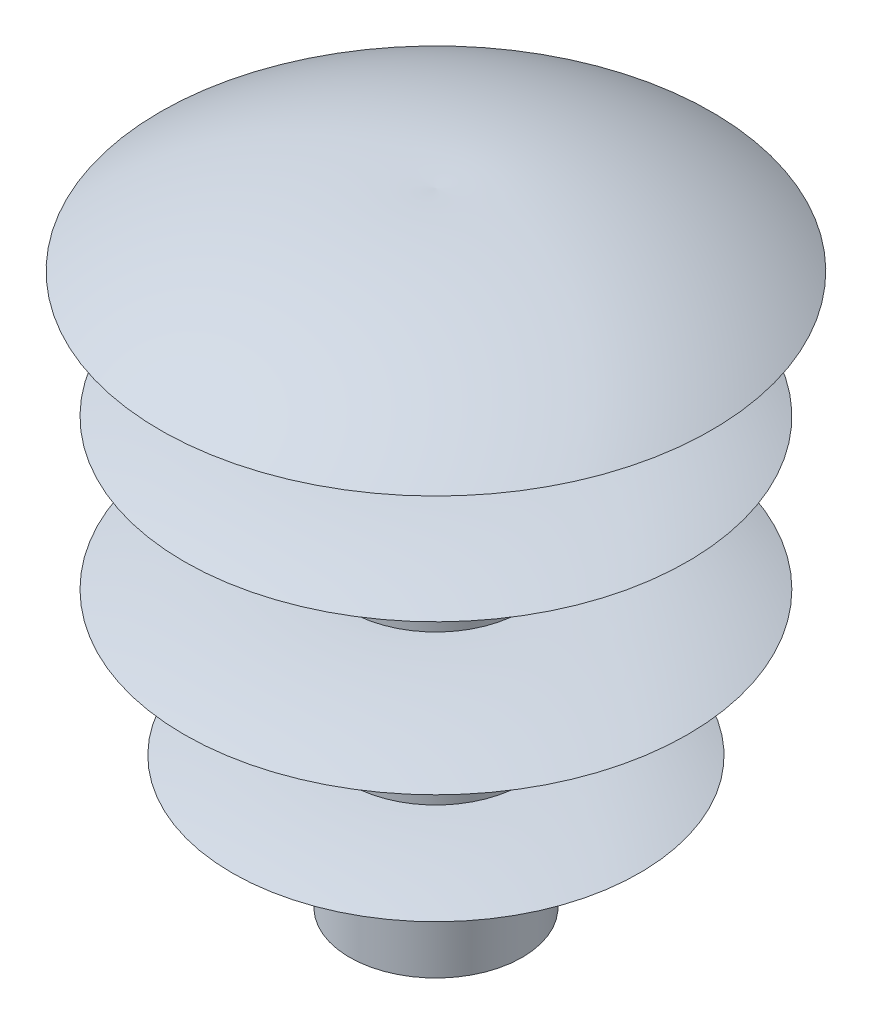
ISO-10303-21;
HEADER;
FILE_DESCRIPTION(('STEP AP214'),'2;1');
FILE_NAME('part.step','',(''),(''),'','','');
FILE_SCHEMA(('AUTOMOTIVE_DESIGN { 1 0 10303 214 1 1 1 1 }'));
ENDSEC;
DATA;
#1=APPLICATION_CONTEXT('core data for automotive mechanical design processes');
#2=APPLICATION_PROTOCOL_DEFINITION('international standard','automotive_design',2000,#1);
#3=PRODUCT_CONTEXT('',#1,'mechanical');
#4=PRODUCT('Part','Part','',(#3));
#5=PRODUCT_RELATED_PRODUCT_CATEGORY('part','',(#4));
#6=PRODUCT_DEFINITION_FORMATION('','',#4);
#7=PRODUCT_DEFINITION_CONTEXT('part definition',#1,'design');
#8=PRODUCT_DEFINITION('design','',#6,#7);
#9=PRODUCT_DEFINITION_SHAPE('','',#8);
#10=(LENGTH_UNIT() NAMED_UNIT(*) SI_UNIT(.MILLI.,.METRE.));
#11=(NAMED_UNIT(*) PLANE_ANGLE_UNIT() SI_UNIT($,.RADIAN.));
#12=(NAMED_UNIT(*) SI_UNIT($,.STERADIAN.) SOLID_ANGLE_UNIT());
#13=UNCERTAINTY_MEASURE_WITH_UNIT(LENGTH_MEASURE(1.E-05),#10,'distance_accuracy_value','');
#14=(GEOMETRIC_REPRESENTATION_CONTEXT(3) GLOBAL_UNCERTAINTY_ASSIGNED_CONTEXT((#13)) GLOBAL_UNIT_ASSIGNED_CONTEXT((#10,
#11,#12)) REPRESENTATION_CONTEXT('',''));
#15=CARTESIAN_POINT('',(0.,0.,0.));
#16=DIRECTION('',(0.,0.,1.));
#17=DIRECTION('',(1.,0.,0.));
#18=AXIS2_PLACEMENT_3D('',#15,#16,#17);
#19=CARTESIAN_POINT('',(0.900000000000001,-13.,0.));
#20=DIRECTION('',(0.,-1.,0.));
#21=DIRECTION('',(0.,0.,-1.));
#22=AXIS2_PLACEMENT_3D('',#19,#20,#21);
#23=PLANE('',#22);
#24=CARTESIAN_POINT('',(0.,-13.,0.));
#25=DIRECTION('',(0.,-1.,0.));
#26=DIRECTION('',(1.,0.,0.));
#27=AXIS2_PLACEMENT_3D('',#24,#25,#26);
#28=CIRCLE('',#27,1.8);
#29=CARTESIAN_POINT('',(1.8,-13.,0.));
#30=VERTEX_POINT('',#29);
#31=EDGE_CURVE('E20',#30,#30,#28,.F.);
#32=ORIENTED_EDGE('',*,*,#31,.F.);
#33=EDGE_LOOP('',(#32));
#34=FACE_BOUND('',#33,.T.);
#35=ADVANCED_FACE('F16',(#34),#23,.T.);
#36=CARTESIAN_POINT('',(0.,-11.8125,0.));
#37=DIRECTION('',(0.,-1.,0.));
#38=DIRECTION('',(1.,0.,0.));
#39=AXIS2_PLACEMENT_3D('',#36,#37,#38);
#40=CYLINDRICAL_SURFACE('',#39,1.8);
#41=CARTESIAN_POINT('',(0.,-10.625,0.));
#42=DIRECTION('',(0.,1.,0.));
#43=DIRECTION('',(0.,0.,1.));
#44=AXIS2_PLACEMENT_3D('',#41,#42,#43);
#45=CIRCLE('',#44,1.8);
#46=CARTESIAN_POINT('',(0.,-10.625,1.8));
#47=VERTEX_POINT('',#46);
#48=EDGE_CURVE('E126',#47,#47,#45,.T.);
#49=ORIENTED_EDGE('',*,*,#48,.F.);
#50=EDGE_LOOP('',(#49));
#51=FACE_BOUND('',#50,.T.);
#52=ORIENTED_EDGE('',*,*,#31,.T.);
#53=EDGE_LOOP('',(#52));
#54=FACE_BOUND('',#53,.T.);
#55=ADVANCED_FACE('F58',(#51,#54),#40,.T.);
#56=CARTESIAN_POINT('',(0.,-2.09519591345399,0.));
#57=DIRECTION('',(0.,1.,0.));
#58=DIRECTION('',(0.,0.,1.));
#59=AXIS2_PLACEMENT_3D('',#56,#57,#58);
#60=DEGENERATE_TOROIDAL_SURFACE('',#59,1.74811672144705,8.52996187737381,.T.);
#61=CARTESIAN_POINT('',(0.,-10.25,0.));
#62=DIRECTION('',(0.,1.,0.));
#63=DIRECTION('',(0.,0.,1.));
#64=AXIS2_PLACEMENT_3D('',#61,#62,#63);
#65=CIRCLE('',#64,4.25000000000002);
#66=CARTESIAN_POINT('',(0.,-10.25,4.25000000000002));
#67=VERTEX_POINT('',#66);
#68=EDGE_CURVE('E121',#67,#67,#65,.T.);
#69=ORIENTED_EDGE('',*,*,#68,.F.);
#70=EDGE_LOOP('',(#69));
#71=FACE_BOUND('',#70,.T.);
#72=ORIENTED_EDGE('',*,*,#48,.T.);
#73=EDGE_LOOP('',(#72));
#74=FACE_BOUND('',#73,.T.);
#75=ADVANCED_FACE('F61',(#71,#74),#60,.T.);
#76=CARTESIAN_POINT('',(0.,-18.0915807569011,0.));
#77=DIRECTION('',(0.,1.,0.));
#78=DIRECTION('',(0.,0.,1.));
#79=AXIS2_PLACEMENT_3D('',#76,#77,#78);
#80=DEGENERATE_TOROIDAL_SURFACE('',#79,1.79605906782127,8.21658170199891,.T.);
#81=CARTESIAN_POINT('',(0.,-9.875,0.));
#82=DIRECTION('',(0.,-1.,0.));
#83=DIRECTION('',(1.,0.,0.));
#84=AXIS2_PLACEMENT_3D('',#81,#82,#83);
#85=CIRCLE('',#84,1.8);
#86=CARTESIAN_POINT('',(1.8,-9.875,0.));
#87=VERTEX_POINT('',#86);
#88=EDGE_CURVE('E116',#87,#87,#85,.F.);
#89=ORIENTED_EDGE('',*,*,#88,.F.);
#90=EDGE_LOOP('',(#89));
#91=FACE_BOUND('',#90,.T.);
#92=ORIENTED_EDGE('',*,*,#68,.T.);
#93=EDGE_LOOP('',(#92));
#94=FACE_BOUND('',#93,.T.);
#95=ADVANCED_FACE('F56',(#91,#94),#80,.T.);
#96=CARTESIAN_POINT('',(0.,-8.8125,0.));
#97=DIRECTION('',(0.,-1.,0.));
#98=DIRECTION('',(1.,0.,0.));
#99=AXIS2_PLACEMENT_3D('',#96,#97,#98);
#100=CYLINDRICAL_SURFACE('',#99,1.8);
#101=CARTESIAN_POINT('',(0.,-7.75,0.));
#102=DIRECTION('',(0.,1.,0.));
#103=DIRECTION('',(-1.,0.,0.));
#104=AXIS2_PLACEMENT_3D('',#101,#102,#103);
#105=CIRCLE('',#104,1.8);
#106=CARTESIAN_POINT('',(-1.8,-7.75000000000001,0.));
#107=VERTEX_POINT('',#106);
#108=EDGE_CURVE('E111',#107,#107,#105,.T.);
#109=ORIENTED_EDGE('',*,*,#108,.F.);
#110=EDGE_LOOP('',(#109));
#111=FACE_BOUND('',#110,.T.);
#112=ORIENTED_EDGE('',*,*,#88,.T.);
#113=EDGE_LOOP('',(#112));
#114=FACE_BOUND('',#113,.T.);
#115=ADVANCED_FACE('F52',(#111,#114),#100,.T.);
#116=CARTESIAN_POINT('',(0.,0.446554940008352,0.));
#117=DIRECTION('',(0.,1.,0.));
#118=DIRECTION('',(-1.,0.,0.));
#119=AXIS2_PLACEMENT_3D('',#116,#117,#118);
#120=DEGENERATE_TOROIDAL_SURFACE('',#119,2.37332537101328,8.21658170199888,.T.);
#121=CARTESIAN_POINT('',(0.,-7.25000000000001,0.));
#122=DIRECTION('',(0.,1.,0.));
#123=DIRECTION('',(-1.,0.,0.));
#124=AXIS2_PLACEMENT_3D('',#121,#122,#123);
#125=CIRCLE('',#124,5.25000000000002);
#126=CARTESIAN_POINT('',(-5.25000000000002,-7.25000000000001,0.));
#127=VERTEX_POINT('',#126);
#128=EDGE_CURVE('E106',#127,#127,#125,.T.);
#129=ORIENTED_EDGE('',*,*,#128,.F.);
#130=EDGE_LOOP('',(#129));
#131=FACE_BOUND('',#130,.T.);
#132=ORIENTED_EDGE('',*,*,#108,.T.);
#133=EDGE_LOOP('',(#132));
#134=FACE_BOUND('',#133,.T.);
#135=ADVANCED_FACE('F55',(#131,#134),#120,.T.);
#136=CARTESIAN_POINT('',(0.,-15.8490064658301,0.));
#137=DIRECTION('',(0.,1.,0.));
#138=DIRECTION('',(0.,0.,1.));
#139=AXIS2_PLACEMENT_3D('',#136,#137,#138);
#140=DEGENERATE_TOROIDAL_SURFACE('',#139,2.24253529480724,9.10976158592354,.T.);
#141=CARTESIAN_POINT('',(0.,-6.75,0.));
#142=DIRECTION('',(0.,-1.,0.));
#143=DIRECTION('',(1.,0.,0.));
#144=AXIS2_PLACEMENT_3D('',#141,#142,#143);
#145=CIRCLE('',#144,1.8);
#146=CARTESIAN_POINT('',(1.8,-6.75,0.));
#147=VERTEX_POINT('',#146);
#148=EDGE_CURVE('E95',#147,#147,#145,.F.);
#149=ORIENTED_EDGE('',*,*,#148,.F.);
#150=EDGE_LOOP('',(#149));
#151=FACE_BOUND('',#150,.T.);
#152=ORIENTED_EDGE('',*,*,#128,.T.);
#153=EDGE_LOOP('',(#152));
#154=FACE_BOUND('',#153,.T.);
#155=ADVANCED_FACE('F50',(#151,#154),#140,.T.);
#156=CARTESIAN_POINT('',(0.,-5.6875,0.));
#157=DIRECTION('',(0.,-1.,0.));
#158=DIRECTION('',(1.,0.,0.));
#159=AXIS2_PLACEMENT_3D('',#156,#157,#158);
#160=CYLINDRICAL_SURFACE('',#159,1.8);
#161=CARTESIAN_POINT('',(0.,-4.625,0.));
#162=DIRECTION('',(0.,1.,0.));
#163=DIRECTION('',(0.,0.,1.));
#164=AXIS2_PLACEMENT_3D('',#161,#162,#163);
#165=CIRCLE('',#164,1.8);
#166=CARTESIAN_POINT('',(0.,-4.625,1.8));
#167=VERTEX_POINT('',#166);
#168=EDGE_CURVE('E91',#167,#167,#165,.T.);
#169=ORIENTED_EDGE('',*,*,#168,.F.);
#170=EDGE_LOOP('',(#169));
#171=FACE_BOUND('',#170,.T.);
#172=ORIENTED_EDGE('',*,*,#148,.T.);
#173=EDGE_LOOP('',(#172));
#174=FACE_BOUND('',#173,.T.);
#175=ADVANCED_FACE('F46',(#171,#174),#160,.T.);
#176=CARTESIAN_POINT('',(0.,4.47400646583009,0.));
#177=DIRECTION('',(0.,1.,0.));
#178=DIRECTION('',(-1.,0.,0.));
#179=AXIS2_PLACEMENT_3D('',#176,#177,#178);
#180=DEGENERATE_TOROIDAL_SURFACE('',#179,2.24253529480723,9.10976158592353,.T.);
#181=CARTESIAN_POINT('',(0.,-4.12500000000001,0.));
#182=DIRECTION('',(0.,1.,0.));
#183=DIRECTION('',(0.,0.,1.));
#184=AXIS2_PLACEMENT_3D('',#181,#182,#183);
#185=CIRCLE('',#184,5.25000000000002);
#186=CARTESIAN_POINT('',(0.,-4.12500000000001,5.25000000000002));
#187=VERTEX_POINT('',#186);
#188=EDGE_CURVE('E90',#187,#187,#185,.T.);
#189=ORIENTED_EDGE('',*,*,#188,.F.);
#190=EDGE_LOOP('',(#189));
#191=FACE_BOUND('',#190,.T.);
#192=ORIENTED_EDGE('',*,*,#168,.T.);
#193=EDGE_LOOP('',(#192));
#194=FACE_BOUND('',#193,.T.);
#195=ADVANCED_FACE('F49',(#191,#194),#180,.T.);
#196=CARTESIAN_POINT('',(0.,-11.8215549400084,0.));
#197=DIRECTION('',(0.,1.,0.));
#198=DIRECTION('',(0.,0.,1.));
#199=AXIS2_PLACEMENT_3D('',#196,#197,#198);
#200=DEGENERATE_TOROIDAL_SURFACE('',#199,2.37332537101327,8.21658170199889,.T.);
#201=CARTESIAN_POINT('',(0.,-3.625,0.));
#202=DIRECTION('',(0.,-1.,0.));
#203=DIRECTION('',(1.,0.,0.));
#204=AXIS2_PLACEMENT_3D('',#201,#202,#203);
#205=CIRCLE('',#204,1.8);
#206=CARTESIAN_POINT('',(1.8,-3.625,0.));
#207=VERTEX_POINT('',#206);
#208=EDGE_CURVE('E87',#207,#207,#205,.F.);
#209=ORIENTED_EDGE('',*,*,#208,.F.);
#210=EDGE_LOOP('',(#209));
#211=FACE_BOUND('',#210,.T.);
#212=ORIENTED_EDGE('',*,*,#188,.T.);
#213=EDGE_LOOP('',(#212));
#214=FACE_BOUND('',#213,.T.);
#215=ADVANCED_FACE('F41',(#211,#214),#200,.T.);
#216=CARTESIAN_POINT('',(0.,-2.5625,0.));
#217=DIRECTION('',(0.,-1.,0.));
#218=DIRECTION('',(1.,0.,0.));
#219=AXIS2_PLACEMENT_3D('',#216,#217,#218);
#220=CYLINDRICAL_SURFACE('',#219,1.8);
#221=CARTESIAN_POINT('',(0.,-1.5,0.));
#222=DIRECTION('',(0.,-1.,0.));
#223=DIRECTION('',(1.,0.,0.));
#224=AXIS2_PLACEMENT_3D('',#221,#222,#223);
#225=CIRCLE('',#224,1.8);
#226=CARTESIAN_POINT('',(1.8,-1.5,0.));
#227=VERTEX_POINT('',#226);
#228=EDGE_CURVE('E24',#227,#227,#225,.F.);
#229=ORIENTED_EDGE('',*,*,#228,.F.);
#230=EDGE_LOOP('',(#229));
#231=FACE_BOUND('',#230,.T.);
#232=ORIENTED_EDGE('',*,*,#208,.T.);
#233=EDGE_LOOP('',(#232));
#234=FACE_BOUND('',#233,.T.);
#235=ADVANCED_FACE('F34',(#231,#234),#220,.T.);
#236=CARTESIAN_POINT('',(3.775,-1.5,0.));
#237=DIRECTION('',(0.,-1.,0.));
#238=DIRECTION('',(0.,0.,-1.));
#239=AXIS2_PLACEMENT_3D('',#236,#237,#238);
#240=PLANE('',#239);
#241=ORIENTED_EDGE('',*,*,#228,.T.);
#242=EDGE_LOOP('',(#241));
#243=FACE_BOUND('',#242,.T.);
#244=CARTESIAN_POINT('',(0.,-1.5,0.));
#245=DIRECTION('',(0.,1.,0.));
#246=DIRECTION('',(-1.,0.,0.));
#247=AXIS2_PLACEMENT_3D('',#244,#245,#246);
#248=CIRCLE('',#247,5.75);
#249=CARTESIAN_POINT('',(-5.75,-1.5,0.));
#250=VERTEX_POINT('',#249);
#251=EDGE_CURVE('E10',#250,#250,#248,.T.);
#252=ORIENTED_EDGE('',*,*,#251,.F.);
#253=EDGE_LOOP('',(#252));
#254=FACE_BOUND('',#253,.T.);
#255=ADVANCED_FACE('F30',(#243,#254),#240,.T.);
#256=CARTESIAN_POINT('',(-0.635017772244038,-9.33659853973117,0.));
#257=DIRECTION('',(0.,0.,-1.));
#258=DIRECTION('',(-1.,0.,0.));
#259=AXIS2_PLACEMENT_3D('',#256,#257,#258);
#260=CIRCLE('',#259,9.35816861694509);
#261=TRIMMED_CURVE('',#260,(PARAMETER_VALUE(-1.63870556657343)),
(PARAMETER_VALUE(1.63870556657343)),.T.,.PARAMETER.);
#262=CARTESIAN_POINT('',(0.,-9.33659853973117,0.));
#263=DIRECTION('',(0.,1.,0.));
#264=AXIS1_PLACEMENT('',#262,#263);
#265=SURFACE_OF_REVOLUTION('',#261,#264);
#266=CARTESIAN_POINT('',(0.,0.,0.));
#267=VERTEX_POINT('',#266);
#268=VERTEX_LOOP('',#267);
#269=FACE_BOUND('',#268,.T.);
#270=ORIENTED_EDGE('',*,*,#251,.T.);
#271=EDGE_LOOP('',(#270));
#272=FACE_BOUND('',#271,.T.);
#273=ADVANCED_FACE('F18',(#269,#272),#265,.T.);
#274=CLOSED_SHELL('',(#35,#55,#75,#95,#115,#135,#155,#175,#195,#215,#235,#255,#273));
#275=MANIFOLD_SOLID_BREP('B1',#274);
#276=ADVANCED_BREP_SHAPE_REPRESENTATION('',(#18,#275),#14);
#277=SHAPE_DEFINITION_REPRESENTATION(#9,#276);
ENDSEC;
END-ISO-10303-21;
